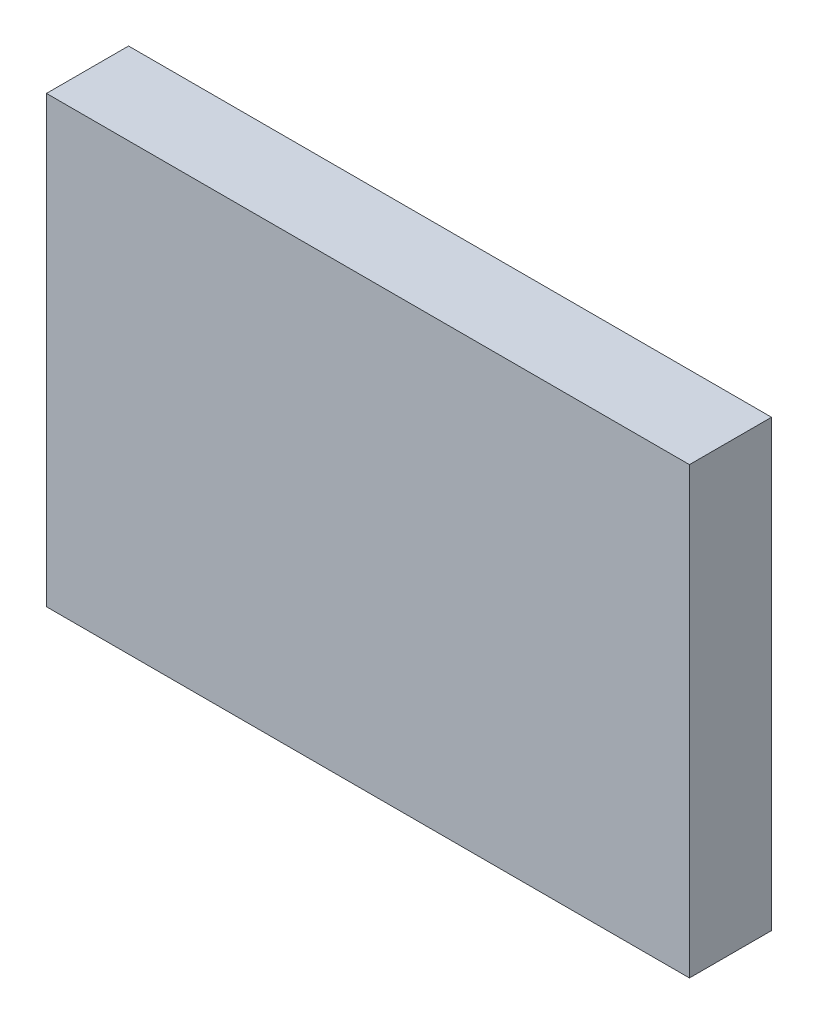
ISO-10303-21;
HEADER;
FILE_DESCRIPTION(('STEP AP214'),'2;1');
FILE_NAME('part.step','',(''),(''),'','','');
FILE_SCHEMA(('AUTOMOTIVE_DESIGN { 1 0 10303 214 1 1 1 1 }'));
ENDSEC;
DATA;
#1=APPLICATION_CONTEXT('core data for automotive mechanical design processes');
#2=APPLICATION_PROTOCOL_DEFINITION('international standard','automotive_design',2000,#1);
#3=PRODUCT_CONTEXT('',#1,'mechanical');
#4=PRODUCT('Part','Part','',(#3));
#5=PRODUCT_RELATED_PRODUCT_CATEGORY('part','',(#4));
#6=PRODUCT_DEFINITION_FORMATION('','',#4);
#7=PRODUCT_DEFINITION_CONTEXT('part definition',#1,'design');
#8=PRODUCT_DEFINITION('design','',#6,#7);
#9=PRODUCT_DEFINITION_SHAPE('','',#8);
#10=(LENGTH_UNIT() NAMED_UNIT(*) SI_UNIT(.MILLI.,.METRE.));
#11=(NAMED_UNIT(*) PLANE_ANGLE_UNIT() SI_UNIT($,.RADIAN.));
#12=(NAMED_UNIT(*) SI_UNIT($,.STERADIAN.) SOLID_ANGLE_UNIT());
#13=UNCERTAINTY_MEASURE_WITH_UNIT(LENGTH_MEASURE(1.E-05),#10,'distance_accuracy_value','');
#14=(GEOMETRIC_REPRESENTATION_CONTEXT(3) GLOBAL_UNCERTAINTY_ASSIGNED_CONTEXT((#13)) GLOBAL_UNIT_ASSIGNED_CONTEXT((#10,
#11,#12)) REPRESENTATION_CONTEXT('',''));
#15=CARTESIAN_POINT('',(0.,0.,0.));
#16=DIRECTION('',(0.,0.,1.));
#17=DIRECTION('',(1.,0.,0.));
#18=AXIS2_PLACEMENT_3D('',#15,#16,#17);
#19=CARTESIAN_POINT('',(-1.17499892,0.81250028,0.));
#20=DIRECTION('',(0.,1.,0.));
#21=DIRECTION('',(1.,0.,0.));
#22=AXIS2_PLACEMENT_3D('',#19,#20,#21);
#23=PLANE('',#22);
#24=DIRECTION('',(0.,0.,1.));
#25=VECTOR('',#24,1.);
#26=CARTESIAN_POINT('',(-1.17499892,0.81250028,0.));
#27=LINE('',#26,#25);
#28=CARTESIAN_POINT('',(-1.17499892,0.81250028,0.));
#29=VERTEX_POINT('',#28);
#30=CARTESIAN_POINT('',(-1.17499892,0.81250028,0.2999994));
#31=VERTEX_POINT('',#30);
#32=EDGE_CURVE('E11',#29,#31,#27,.T.);
#33=ORIENTED_EDGE('',*,*,#32,.T.);
#34=DIRECTION('',(1.,0.,0.));
#35=VECTOR('',#34,1.);
#36=CARTESIAN_POINT('',(-1.17499892,0.81250028,0.2999994));
#37=LINE('',#36,#35);
#38=CARTESIAN_POINT('',(1.17500146,0.81250028,0.2999994));
#39=VERTEX_POINT('',#38);
#40=EDGE_CURVE('E24',#31,#39,#37,.T.);
#41=ORIENTED_EDGE('',*,*,#40,.T.);
#42=DIRECTION('',(0.,0.,1.));
#43=VECTOR('',#42,1.);
#44=CARTESIAN_POINT('',(1.17500146,0.81250028,0.));
#45=LINE('',#44,#43);
#46=CARTESIAN_POINT('',(1.17500146,0.81250028,0.));
#47=VERTEX_POINT('',#46);
#48=EDGE_CURVE('E85',#47,#39,#45,.T.);
#49=ORIENTED_EDGE('',*,*,#48,.F.);
#50=DIRECTION('',(1.,0.,0.));
#51=VECTOR('',#50,1.);
#52=CARTESIAN_POINT('',(-1.17499892,0.81250028,0.));
#53=LINE('',#52,#51);
#54=EDGE_CURVE('E83',#29,#47,#53,.T.);
#55=ORIENTED_EDGE('',*,*,#54,.F.);
#56=EDGE_LOOP('',(#33,#41,#49,#55));
#57=FACE_BOUND('',#56,.T.);
#58=ADVANCED_FACE('F17',(#57),#23,.T.);
#59=CARTESIAN_POINT('',(1.17500146,0.81250028,0.));
#60=DIRECTION('',(1.,0.,0.));
#61=DIRECTION('',(0.,-1.,0.));
#62=AXIS2_PLACEMENT_3D('',#59,#60,#61);
#63=PLANE('',#62);
#64=ORIENTED_EDGE('',*,*,#48,.T.);
#65=DIRECTION('',(0.,-1.,0.));
#66=VECTOR('',#65,1.);
#67=CARTESIAN_POINT('',(1.17500146,0.81250028,0.2999994));
#68=LINE('',#67,#66);
#69=CARTESIAN_POINT('',(1.17500146,-0.81250028,0.2999994));
#70=VERTEX_POINT('',#69);
#71=EDGE_CURVE('E81',#39,#70,#68,.T.);
#72=ORIENTED_EDGE('',*,*,#71,.T.);
#73=DIRECTION('',(0.,0.,1.));
#74=VECTOR('',#73,1.);
#75=CARTESIAN_POINT('',(1.17500146,-0.81250028,0.));
#76=LINE('',#75,#74);
#77=CARTESIAN_POINT('',(1.17500146,-0.81250028,0.));
#78=VERTEX_POINT('',#77);
#79=EDGE_CURVE('E79',#78,#70,#76,.T.);
#80=ORIENTED_EDGE('',*,*,#79,.F.);
#81=DIRECTION('',(0.,-1.,0.));
#82=VECTOR('',#81,1.);
#83=CARTESIAN_POINT('',(1.17500146,0.81250028,0.));
#84=LINE('',#83,#82);
#85=EDGE_CURVE('E70',#47,#78,#84,.T.);
#86=ORIENTED_EDGE('',*,*,#85,.F.);
#87=EDGE_LOOP('',(#64,#72,#80,#86));
#88=FACE_BOUND('',#87,.T.);
#89=ADVANCED_FACE('F90',(#88),#63,.T.);
#90=CARTESIAN_POINT('',(1.17500146,-0.81250028,0.));
#91=DIRECTION('',(0.,-1.,0.));
#92=DIRECTION('',(-1.,0.,0.));
#93=AXIS2_PLACEMENT_3D('',#90,#91,#92);
#94=PLANE('',#93);
#95=ORIENTED_EDGE('',*,*,#79,.T.);
#96=DIRECTION('',(-1.,0.,0.));
#97=VECTOR('',#96,1.);
#98=CARTESIAN_POINT('',(1.17500146,-0.81250028,0.2999994));
#99=LINE('',#98,#97);
#100=CARTESIAN_POINT('',(-1.17499892,-0.81250028,0.2999994));
#101=VERTEX_POINT('',#100);
#102=EDGE_CURVE('E60',#70,#101,#99,.T.);
#103=ORIENTED_EDGE('',*,*,#102,.T.);
#104=DIRECTION('',(0.,0.,1.));
#105=VECTOR('',#104,1.);
#106=CARTESIAN_POINT('',(-1.17499892,-0.81250028,0.));
#107=LINE('',#106,#105);
#108=CARTESIAN_POINT('',(-1.17499892,-0.81250028,0.));
#109=VERTEX_POINT('',#108);
#110=EDGE_CURVE('E54',#109,#101,#107,.T.);
#111=ORIENTED_EDGE('',*,*,#110,.F.);
#112=DIRECTION('',(-1.,0.,0.));
#113=VECTOR('',#112,1.);
#114=CARTESIAN_POINT('',(1.17500146,-0.81250028,0.));
#115=LINE('',#114,#113);
#116=EDGE_CURVE('E58',#78,#109,#115,.T.);
#117=ORIENTED_EDGE('',*,*,#116,.F.);
#118=EDGE_LOOP('',(#95,#103,#111,#117));
#119=FACE_BOUND('',#118,.T.);
#120=ADVANCED_FACE('F57',(#119),#94,.T.);
#121=CARTESIAN_POINT('',(-1.17499892,-0.81250028,0.));
#122=DIRECTION('',(-1.,0.,0.));
#123=DIRECTION('',(0.,1.,0.));
#124=AXIS2_PLACEMENT_3D('',#121,#122,#123);
#125=PLANE('',#124);
#126=ORIENTED_EDGE('',*,*,#110,.T.);
#127=DIRECTION('',(0.,1.,0.));
#128=VECTOR('',#127,1.);
#129=CARTESIAN_POINT('',(-1.17499892,-0.81250028,0.2999994));
#130=LINE('',#129,#128);
#131=EDGE_CURVE('E71',#101,#31,#130,.T.);
#132=ORIENTED_EDGE('',*,*,#131,.T.);
#133=ORIENTED_EDGE('',*,*,#32,.F.);
#134=DIRECTION('',(0.,1.,0.));
#135=VECTOR('',#134,1.);
#136=CARTESIAN_POINT('',(-1.17499892,-0.81250028,0.));
#137=LINE('',#136,#135);
#138=EDGE_CURVE('E68',#109,#29,#137,.T.);
#139=ORIENTED_EDGE('',*,*,#138,.F.);
#140=EDGE_LOOP('',(#126,#132,#133,#139));
#141=FACE_BOUND('',#140,.T.);
#142=ADVANCED_FACE('F73',(#141),#125,.T.);
#143=CARTESIAN_POINT('',(1.270000005571E-06,0.,0.));
#144=DIRECTION('',(0.,0.,-1.));
#145=DIRECTION('',(-1.,0.,0.));
#146=AXIS2_PLACEMENT_3D('',#143,#144,#145);
#147=PLANE('',#146);
#148=ORIENTED_EDGE('',*,*,#54,.T.);
#149=ORIENTED_EDGE('',*,*,#85,.T.);
#150=ORIENTED_EDGE('',*,*,#116,.T.);
#151=ORIENTED_EDGE('',*,*,#138,.T.);
#152=EDGE_LOOP('',(#148,#149,#150,#151));
#153=FACE_BOUND('',#152,.T.);
#154=ADVANCED_FACE('F67',(#153),#147,.T.);
#155=CARTESIAN_POINT('',(1.270000005571E-06,0.,0.2999994));
#156=DIRECTION('',(0.,0.,-1.));
#157=DIRECTION('',(-1.,0.,0.));
#158=AXIS2_PLACEMENT_3D('',#155,#156,#157);
#159=PLANE('',#158);
#160=ORIENTED_EDGE('',*,*,#131,.F.);
#161=ORIENTED_EDGE('',*,*,#102,.F.);
#162=ORIENTED_EDGE('',*,*,#71,.F.);
#163=ORIENTED_EDGE('',*,*,#40,.F.);
#164=EDGE_LOOP('',(#160,#161,#162,#163));
#165=FACE_BOUND('',#164,.T.);
#166=ADVANCED_FACE('F91',(#165),#159,.F.);
#167=CLOSED_SHELL('',(#58,#89,#120,#142,#154,#166));
#168=MANIFOLD_SOLID_BREP('B1',#167);
#169=ADVANCED_BREP_SHAPE_REPRESENTATION('',(#18,#168),#14);
#170=SHAPE_DEFINITION_REPRESENTATION(#9,#169);
ENDSEC;
END-ISO-10303-21;
